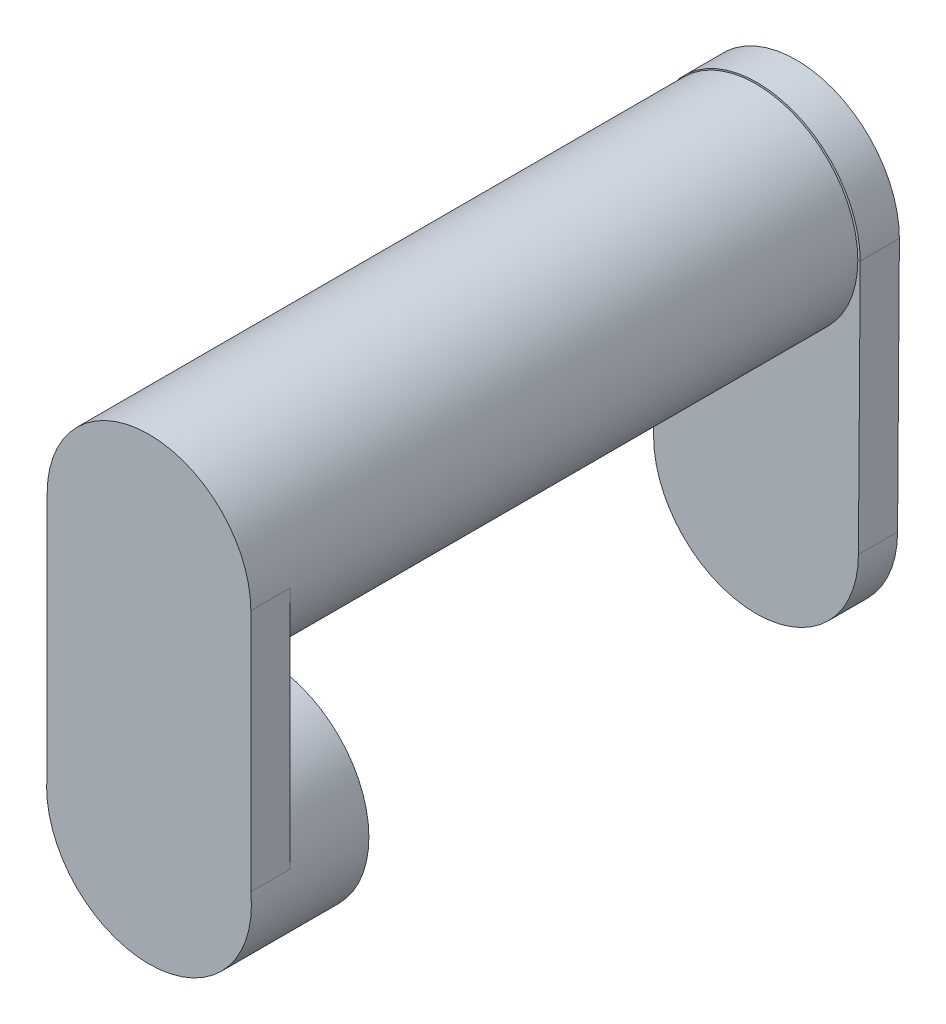
ISO-10303-21;
HEADER;
FILE_DESCRIPTION(('STEP AP214'),'2;1');
FILE_NAME('part.step','',(''),(''),'','','');
FILE_SCHEMA(('AUTOMOTIVE_DESIGN { 1 0 10303 214 1 1 1 1 }'));
ENDSEC;
DATA;
#1=APPLICATION_CONTEXT('core data for automotive mechanical design processes');
#2=APPLICATION_PROTOCOL_DEFINITION('international standard','automotive_design',2000,#1);
#3=PRODUCT_CONTEXT('',#1,'mechanical');
#4=PRODUCT('Part','Part','',(#3));
#5=PRODUCT_RELATED_PRODUCT_CATEGORY('part','',(#4));
#6=PRODUCT_DEFINITION_FORMATION('','',#4);
#7=PRODUCT_DEFINITION_CONTEXT('part definition',#1,'design');
#8=PRODUCT_DEFINITION('design','',#6,#7);
#9=PRODUCT_DEFINITION_SHAPE('','',#8);
#10=(LENGTH_UNIT() NAMED_UNIT(*) SI_UNIT(.MILLI.,.METRE.));
#11=(NAMED_UNIT(*) PLANE_ANGLE_UNIT() SI_UNIT($,.RADIAN.));
#12=(NAMED_UNIT(*) SI_UNIT($,.STERADIAN.) SOLID_ANGLE_UNIT());
#13=UNCERTAINTY_MEASURE_WITH_UNIT(LENGTH_MEASURE(1.E-05),#10,'distance_accuracy_value','');
#14=(GEOMETRIC_REPRESENTATION_CONTEXT(3) GLOBAL_UNCERTAINTY_ASSIGNED_CONTEXT((#13)) GLOBAL_UNIT_ASSIGNED_CONTEXT((#10,
#11,#12)) REPRESENTATION_CONTEXT('',''));
#15=CARTESIAN_POINT('',(0.,0.,0.));
#16=DIRECTION('',(0.,0.,1.));
#17=DIRECTION('',(1.,0.,0.));
#18=AXIS2_PLACEMENT_3D('',#15,#16,#17);
#19=CARTESIAN_POINT('',(0.,0.,30.));
#20=DIRECTION('',(0.,0.,-1.));
#21=DIRECTION('',(-1.,0.,0.));
#22=AXIS2_PLACEMENT_3D('',#19,#20,#21);
#23=CYLINDRICAL_SURFACE('',#22,20.4);
#24=CARTESIAN_POINT('',(0.,0.,0.));
#25=DIRECTION('',(0.,0.,1.));
#26=DIRECTION('',(1.,0.,0.));
#27=AXIS2_PLACEMENT_3D('',#24,#25,#26);
#28=CIRCLE('',#27,20.4);
#29=CARTESIAN_POINT('',(20.4,0.,0.));
#30=VERTEX_POINT('',#29);
#31=EDGE_CURVE('E185',#30,#30,#28,.T.);
#32=ORIENTED_EDGE('',*,*,#31,.F.);
#33=EDGE_LOOP('',(#32));
#34=FACE_BOUND('',#33,.T.);
#35=CARTESIAN_POINT('',(0.,0.,20.));
#36=DIRECTION('',(0.,0.,1.));
#37=DIRECTION('',(1.,0.,0.));
#38=AXIS2_PLACEMENT_3D('',#35,#36,#37);
#39=CIRCLE('',#38,20.4);
#40=CARTESIAN_POINT('',(20.4,0.,20.));
#41=VERTEX_POINT('',#40);
#42=EDGE_CURVE('E182',#41,#41,#39,.T.);
#43=ORIENTED_EDGE('',*,*,#42,.T.);
#44=EDGE_LOOP('',(#43));
#45=FACE_BOUND('',#44,.T.);
#46=ADVANCED_FACE('F49',(#34,#45),#23,.F.);
#47=CARTESIAN_POINT('',(0.,0.,30.));
#48=DIRECTION('',(0.,0.,1.));
#49=DIRECTION('',(1.,0.,0.));
#50=AXIS2_PLACEMENT_3D('',#47,#48,#49);
#51=PLANE('',#50);
#52=CARTESIAN_POINT('',(0.,0.,30.));
#53=DIRECTION('',(0.,0.,1.));
#54=DIRECTION('',(1.,0.,0.));
#55=AXIS2_PLACEMENT_3D('',#52,#53,#54);
#56=CIRCLE('',#55,26.15);
#57=CARTESIAN_POINT('',(-26.,2.79687325418945,30.));
#58=VERTEX_POINT('',#57);
#59=CARTESIAN_POINT('',(26.,2.79687325418946,30.));
#60=VERTEX_POINT('',#59);
#61=EDGE_CURVE('E189',#58,#60,#56,.T.);
#62=ORIENTED_EDGE('',*,*,#61,.T.);
#63=DIRECTION('',(0.,1.,0.));
#64=VECTOR('',#63,1.);
#65=CARTESIAN_POINT('',(26.,65.,30.));
#66=LINE('',#65,#64);
#67=CARTESIAN_POINT('',(26.,65.,30.));
#68=VERTEX_POINT('',#67);
#69=EDGE_CURVE('E172',#60,#68,#66,.T.);
#70=ORIENTED_EDGE('',*,*,#69,.T.);
#71=CARTESIAN_POINT('',(0.,65.,30.));
#72=DIRECTION('',(0.,0.,1.));
#73=DIRECTION('',(1.,0.,0.));
#74=AXIS2_PLACEMENT_3D('',#71,#72,#73);
#75=CIRCLE('',#74,26.);
#76=CARTESIAN_POINT('',(-26.,65.,30.));
#77=VERTEX_POINT('',#76);
#78=EDGE_CURVE('E168',#68,#77,#75,.T.);
#79=ORIENTED_EDGE('',*,*,#78,.T.);
#80=DIRECTION('',(0.,-1.,0.));
#81=VECTOR('',#80,1.);
#82=CARTESIAN_POINT('',(-26.,65.,30.));
#83=LINE('',#82,#81);
#84=EDGE_CURVE('E65',#77,#58,#83,.T.);
#85=ORIENTED_EDGE('',*,*,#84,.T.);
#86=EDGE_LOOP('',(#62,#70,#79,#85));
#87=FACE_BOUND('',#86,.T.);
#88=ADVANCED_FACE('F202',(#87),#51,.T.);
#89=CARTESIAN_POINT('',(0.,0.,0.));
#90=DIRECTION('',(0.,0.,1.));
#91=DIRECTION('',(1.,0.,0.));
#92=AXIS2_PLACEMENT_3D('',#89,#90,#91);
#93=PLANE('',#92);
#94=CARTESIAN_POINT('',(0.,0.,0.));
#95=DIRECTION('',(0.,0.,1.));
#96=DIRECTION('',(1.,0.,0.));
#97=AXIS2_PLACEMENT_3D('',#94,#95,#96);
#98=CIRCLE('',#97,26.15);
#99=CARTESIAN_POINT('',(26.15,0.,0.));
#100=VERTEX_POINT('',#99);
#101=EDGE_CURVE('E188',#100,#100,#98,.T.);
#102=ORIENTED_EDGE('',*,*,#101,.F.);
#103=EDGE_LOOP('',(#102));
#104=FACE_BOUND('',#103,.T.);
#105=ORIENTED_EDGE('',*,*,#31,.T.);
#106=EDGE_LOOP('',(#105));
#107=FACE_BOUND('',#106,.T.);
#108=ADVANCED_FACE('F237',(#104,#107),#93,.F.);
#109=CARTESIAN_POINT('',(0.,0.,30.));
#110=DIRECTION('',(0.,0.,-1.));
#111=DIRECTION('',(-1.,0.,0.));
#112=AXIS2_PLACEMENT_3D('',#109,#110,#111);
#113=CYLINDRICAL_SURFACE('',#112,26.15);
#114=CARTESIAN_POINT('',(0.,0.,20.));
#115=DIRECTION('',(0.,0.,1.));
#116=DIRECTION('',(1.,0.,0.));
#117=AXIS2_PLACEMENT_3D('',#114,#115,#116);
#118=CIRCLE('',#117,26.15);
#119=CARTESIAN_POINT('',(26.,2.79687325418946,20.));
#120=VERTEX_POINT('',#119);
#121=CARTESIAN_POINT('',(-26.,2.79687325418945,20.));
#122=VERTEX_POINT('',#121);
#123=EDGE_CURVE('E73',#120,#122,#118,.T.);
#124=ORIENTED_EDGE('',*,*,#123,.F.);
#125=DIRECTION('',(0.,0.,-1.));
#126=VECTOR('',#125,1.);
#127=CARTESIAN_POINT('',(26.,2.79687325418946,30.));
#128=LINE('',#127,#126);
#129=EDGE_CURVE('E58',#120,#60,#128,.F.);
#130=ORIENTED_EDGE('',*,*,#129,.T.);
#131=ORIENTED_EDGE('',*,*,#61,.F.);
#132=DIRECTION('',(0.,0.,-1.));
#133=VECTOR('',#132,1.);
#134=CARTESIAN_POINT('',(-26.,2.79687325418945,30.));
#135=LINE('',#134,#133);
#136=EDGE_CURVE('E191',#58,#122,#135,.T.);
#137=ORIENTED_EDGE('',*,*,#136,.T.);
#138=EDGE_LOOP('',(#124,#130,#131,#137));
#139=FACE_BOUND('',#138,.T.);
#140=ORIENTED_EDGE('',*,*,#101,.T.);
#141=EDGE_LOOP('',(#140));
#142=FACE_BOUND('',#141,.T.);
#143=ADVANCED_FACE('F51',(#139,#142),#113,.T.);
#144=CARTESIAN_POINT('',(0.,65.,20.));
#145=DIRECTION('',(0.,0.,1.));
#146=DIRECTION('',(1.,0.,0.));
#147=AXIS2_PLACEMENT_3D('',#144,#145,#146);
#148=PLANE('',#147);
#149=ORIENTED_EDGE('',*,*,#42,.F.);
#150=EDGE_LOOP('',(#149));
#151=FACE_BOUND('',#150,.T.);
#152=ADVANCED_FACE('F216',(#151),#148,.F.);
#153=CARTESIAN_POINT('',(26.,65.,20.));
#154=DIRECTION('',(1.,0.,0.));
#155=DIRECTION('',(0.,1.,0.));
#156=AXIS2_PLACEMENT_3D('',#153,#154,#155);
#157=PLANE('',#156);
#158=ORIENTED_EDGE('',*,*,#129,.F.);
#159=DIRECTION('',(0.,1.,0.));
#160=VECTOR('',#159,1.);
#161=CARTESIAN_POINT('',(26.,65.,20.));
#162=LINE('',#161,#160);
#163=CARTESIAN_POINT('',(26.,65.,20.));
#164=VERTEX_POINT('',#163);
#165=EDGE_CURVE('E171',#120,#164,#162,.T.);
#166=ORIENTED_EDGE('',*,*,#165,.T.);
#167=DIRECTION('',(0.,0.,1.));
#168=VECTOR('',#167,1.);
#169=CARTESIAN_POINT('',(26.,65.,20.));
#170=LINE('',#169,#168);
#171=EDGE_CURVE('E179',#164,#68,#170,.T.);
#172=ORIENTED_EDGE('',*,*,#171,.T.);
#173=ORIENTED_EDGE('',*,*,#69,.F.);
#174=EDGE_LOOP('',(#158,#166,#172,#173));
#175=FACE_BOUND('',#174,.T.);
#176=ADVANCED_FACE('F205',(#175),#157,.T.);
#177=CARTESIAN_POINT('',(-26.,65.,20.));
#178=DIRECTION('',(-1.,0.,0.));
#179=DIRECTION('',(0.,-1.,0.));
#180=AXIS2_PLACEMENT_3D('',#177,#178,#179);
#181=PLANE('',#180);
#182=ORIENTED_EDGE('',*,*,#136,.F.);
#183=ORIENTED_EDGE('',*,*,#84,.F.);
#184=DIRECTION('',(0.,0.,1.));
#185=VECTOR('',#184,1.);
#186=CARTESIAN_POINT('',(-26.,65.,20.));
#187=LINE('',#186,#185);
#188=CARTESIAN_POINT('',(-26.,65.,20.));
#189=VERTEX_POINT('',#188);
#190=EDGE_CURVE('E175',#189,#77,#187,.T.);
#191=ORIENTED_EDGE('',*,*,#190,.F.);
#192=DIRECTION('',(0.,-1.,0.));
#193=VECTOR('',#192,1.);
#194=CARTESIAN_POINT('',(-26.,65.,20.));
#195=LINE('',#194,#193);
#196=EDGE_CURVE('E169',#189,#122,#195,.T.);
#197=ORIENTED_EDGE('',*,*,#196,.T.);
#198=EDGE_LOOP('',(#182,#183,#191,#197));
#199=FACE_BOUND('',#198,.T.);
#200=ADVANCED_FACE('F211',(#199),#181,.T.);
#201=CARTESIAN_POINT('',(0.,65.,20.));
#202=DIRECTION('',(0.,0.,1.));
#203=DIRECTION('',(1.,0.,0.));
#204=AXIS2_PLACEMENT_3D('',#201,#202,#203);
#205=CYLINDRICAL_SURFACE('',#204,26.);
#206=ORIENTED_EDGE('',*,*,#78,.F.);
#207=ORIENTED_EDGE('',*,*,#171,.F.);
#208=CARTESIAN_POINT('',(0.,65.,20.));
#209=DIRECTION('',(0.,0.,1.));
#210=DIRECTION('',(1.,0.,0.));
#211=AXIS2_PLACEMENT_3D('',#208,#209,#210);
#212=CIRCLE('',#211,26.);
#213=EDGE_CURVE('E12',#164,#189,#212,.F.);
#214=ORIENTED_EDGE('',*,*,#213,.T.);
#215=ORIENTED_EDGE('',*,*,#190,.T.);
#216=EDGE_LOOP('',(#206,#207,#214,#215));
#217=FACE_BOUND('',#216,.T.);
#218=CARTESIAN_POINT('',(0.,65.,-125.));
#219=DIRECTION('',(0.,0.,-1.));
#220=DIRECTION('',(-1.,0.,0.));
#221=AXIS2_PLACEMENT_3D('',#218,#219,#220);
#222=CIRCLE('',#221,26.);
#223=CARTESIAN_POINT('',(-26.,65.,-125.));
#224=VERTEX_POINT('',#223);
#225=EDGE_CURVE('E165',#224,#224,#222,.T.);
#226=ORIENTED_EDGE('',*,*,#225,.F.);
#227=EDGE_LOOP('',(#226));
#228=FACE_BOUND('',#227,.T.);
#229=ADVANCED_FACE('F207',(#217,#228),#205,.T.);
#230=ORIENTED_EDGE('',*,*,#213,.F.);
#231=ORIENTED_EDGE('',*,*,#165,.F.);
#232=ORIENTED_EDGE('',*,*,#123,.T.);
#233=ORIENTED_EDGE('',*,*,#196,.F.);
#234=EDGE_LOOP('',(#230,#231,#232,#233));
#235=FACE_BOUND('',#234,.T.);
#236=ADVANCED_FACE('F212',(#235),#148,.F.);
#237=CARTESIAN_POINT('',(-26.1498607403866,0.0603458324778156,-135.));
#238=DIRECTION('',(-0.999997337288742,0.00230768616297403,0.));
#239=DIRECTION('',(-0.00230768616297403,-0.999997337288742,0.));
#240=AXIS2_PLACEMENT_3D('',#237,#238,#239);
#241=PLANE('',#240);
#242=DIRECTION('',(-0.00230768616297403,-0.999997337288742,0.));
#243=VECTOR('',#242,1.);
#244=CARTESIAN_POINT('',(-26.1498607403866,0.0603458324778156,-125.));
#245=LINE('',#244,#243);
#246=CARTESIAN_POINT('',(-26.0024469691093,63.9396467192885,-125.));
#247=VERTEX_POINT('',#246);
#248=CARTESIAN_POINT('',(-26.15,0.,-125.));
#249=VERTEX_POINT('',#248);
#250=EDGE_CURVE('E124',#247,#249,#245,.T.);
#251=ORIENTED_EDGE('',*,*,#250,.F.);
#252=DIRECTION('',(0.,0.,1.));
#253=VECTOR('',#252,1.);
#254=CARTESIAN_POINT('',(-26.0024469691093,63.9396467192885,-135.));
#255=LINE('',#254,#253);
#256=CARTESIAN_POINT('',(-26.0024469691093,63.9396467192885,-135.));
#257=VERTEX_POINT('',#256);
#258=EDGE_CURVE('E118',#257,#247,#255,.T.);
#259=ORIENTED_EDGE('',*,*,#258,.F.);
#260=DIRECTION('',(-0.00230768616297403,-0.999997337288742,0.));
#261=VECTOR('',#260,1.);
#262=CARTESIAN_POINT('',(-26.1498607403866,0.0603458324778156,-135.));
#263=LINE('',#262,#261);
#264=CARTESIAN_POINT('',(-26.15,0.,-135.));
#265=VERTEX_POINT('',#264);
#266=EDGE_CURVE('E122',#257,#265,#263,.T.);
#267=ORIENTED_EDGE('',*,*,#266,.T.);
#268=DIRECTION('',(0.,0.,1.));
#269=VECTOR('',#268,1.);
#270=CARTESIAN_POINT('',(-26.15,0.,-135.));
#271=LINE('',#270,#269);
#272=EDGE_CURVE('E150',#265,#249,#271,.T.);
#273=ORIENTED_EDGE('',*,*,#272,.T.);
#274=EDGE_LOOP('',(#251,#259,#267,#273));
#275=FACE_BOUND('',#274,.T.);
#276=ADVANCED_FACE('F120',(#275),#241,.T.);
#277=CARTESIAN_POINT('',(0.291938013851514,65.1347346864853,-135.));
#278=DIRECTION('',(0.,0.,1.));
#279=DIRECTION('',(1.,0.,0.));
#280=AXIS2_PLACEMENT_3D('',#277,#278,#279);
#281=CYLINDRICAL_SURFACE('',#280,26.3215295315735);
#282=CARTESIAN_POINT('',(0.291938013851514,65.1347346864853,-125.));
#283=DIRECTION('',(0.,0.,-1.));
#284=DIRECTION('',(-1.,0.,0.));
#285=AXIS2_PLACEMENT_3D('',#282,#283,#284);
#286=CIRCLE('',#285,26.3215295315735);
#287=CARTESIAN_POINT('',(26.613467545425,65.1347346864853,-125.));
#288=VERTEX_POINT('',#287);
#289=EDGE_CURVE('E152',#247,#288,#286,.T.);
#290=ORIENTED_EDGE('',*,*,#289,.T.);
#291=DIRECTION('',(0.,0.,1.));
#292=VECTOR('',#291,1.);
#293=CARTESIAN_POINT('',(26.613467545425,65.1347346864853,-135.));
#294=LINE('',#293,#292);
#295=CARTESIAN_POINT('',(26.613467545425,65.1347346864853,-135.));
#296=VERTEX_POINT('',#295);
#297=EDGE_CURVE('E128',#296,#288,#294,.T.);
#298=ORIENTED_EDGE('',*,*,#297,.F.);
#299=CARTESIAN_POINT('',(0.291938013851514,65.1347346864853,-135.));
#300=DIRECTION('',(0.,0.,-1.));
#301=DIRECTION('',(-1.,0.,0.));
#302=AXIS2_PLACEMENT_3D('',#299,#300,#301);
#303=CIRCLE('',#302,26.3215295315735);
#304=EDGE_CURVE('E131',#257,#296,#303,.T.);
#305=ORIENTED_EDGE('',*,*,#304,.F.);
#306=ORIENTED_EDGE('',*,*,#258,.T.);
#307=EDGE_LOOP('',(#290,#298,#305,#306));
#308=FACE_BOUND('',#307,.T.);
#309=ADVANCED_FACE('F132',(#308),#281,.T.);
#310=CARTESIAN_POINT('',(26.1486760759725,-0.18606144287526,-135.));
#311=DIRECTION('',(-0.999974685644663,0.00711534045965502,0.));
#312=DIRECTION('',(-0.00711534045965502,-0.999974685644663,0.));
#313=AXIS2_PLACEMENT_3D('',#310,#311,#312);
#314=PLANE('',#313);
#315=DIRECTION('',(-0.00711534045965502,-0.999974685644663,0.));
#316=VECTOR('',#315,1.);
#317=CARTESIAN_POINT('',(26.1486760759725,-0.18606144287526,-125.));
#318=LINE('',#317,#316);
#319=CARTESIAN_POINT('',(26.1499999999992,0.,-125.));
#320=VERTEX_POINT('',#319);
#321=EDGE_CURVE('E145',#288,#320,#318,.T.);
#322=ORIENTED_EDGE('',*,*,#321,.T.);
#323=DIRECTION('',(0.,0.,1.));
#324=VECTOR('',#323,1.);
#325=CARTESIAN_POINT('',(26.1499999999992,0.,-135.));
#326=LINE('',#325,#324);
#327=CARTESIAN_POINT('',(26.1499999999992,0.,-135.));
#328=VERTEX_POINT('',#327);
#329=EDGE_CURVE('E156',#328,#320,#326,.T.);
#330=ORIENTED_EDGE('',*,*,#329,.F.);
#331=DIRECTION('',(-0.00711534045965502,-0.999974685644663,0.));
#332=VECTOR('',#331,1.);
#333=CARTESIAN_POINT('',(26.1486760759725,-0.18606144287526,-135.));
#334=LINE('',#333,#332);
#335=EDGE_CURVE('E136',#296,#328,#334,.T.);
#336=ORIENTED_EDGE('',*,*,#335,.F.);
#337=ORIENTED_EDGE('',*,*,#297,.T.);
#338=EDGE_LOOP('',(#322,#330,#336,#337));
#339=FACE_BOUND('',#338,.T.);
#340=ADVANCED_FACE('F307',(#339),#314,.F.);
#341=CARTESIAN_POINT('',(0.,0.,-135.));
#342=DIRECTION('',(0.,0.,1.));
#343=DIRECTION('',(1.,0.,0.));
#344=AXIS2_PLACEMENT_3D('',#341,#342,#343);
#345=CYLINDRICAL_SURFACE('',#344,26.1499999999992);
#346=CARTESIAN_POINT('',(0.,0.,-125.));
#347=DIRECTION('',(0.,0.,-1.));
#348=DIRECTION('',(-1.,0.,0.));
#349=AXIS2_PLACEMENT_3D('',#346,#347,#348);
#350=CIRCLE('',#349,26.1499999999992);
#351=EDGE_CURVE('E142',#320,#249,#350,.T.);
#352=ORIENTED_EDGE('',*,*,#351,.T.);
#353=ORIENTED_EDGE('',*,*,#272,.F.);
#354=CARTESIAN_POINT('',(0.,0.,-135.));
#355=DIRECTION('',(0.,0.,-1.));
#356=DIRECTION('',(-1.,0.,0.));
#357=AXIS2_PLACEMENT_3D('',#354,#355,#356);
#358=CIRCLE('',#357,26.1499999999992);
#359=EDGE_CURVE('E140',#328,#265,#358,.T.);
#360=ORIENTED_EDGE('',*,*,#359,.F.);
#361=ORIENTED_EDGE('',*,*,#329,.T.);
#362=EDGE_LOOP('',(#352,#353,#360,#361));
#363=FACE_BOUND('',#362,.T.);
#364=ADVANCED_FACE('F316',(#363),#345,.T.);
#365=CARTESIAN_POINT('',(0.,0.,-135.));
#366=DIRECTION('',(0.,0.,-1.));
#367=DIRECTION('',(-1.,0.,0.));
#368=AXIS2_PLACEMENT_3D('',#365,#366,#367);
#369=PLANE('',#368);
#370=ORIENTED_EDGE('',*,*,#266,.F.);
#371=ORIENTED_EDGE('',*,*,#304,.T.);
#372=ORIENTED_EDGE('',*,*,#335,.T.);
#373=ORIENTED_EDGE('',*,*,#359,.T.);
#374=EDGE_LOOP('',(#370,#371,#372,#373));
#375=FACE_BOUND('',#374,.T.);
#376=ADVANCED_FACE('F138',(#375),#369,.T.);
#377=CARTESIAN_POINT('',(0.,0.,-125.));
#378=DIRECTION('',(0.,0.,-1.));
#379=DIRECTION('',(-1.,0.,0.));
#380=AXIS2_PLACEMENT_3D('',#377,#378,#379);
#381=PLANE('',#380);
#382=ORIENTED_EDGE('',*,*,#225,.T.);
#383=EDGE_LOOP('',(#382));
#384=FACE_BOUND('',#383,.T.);
#385=ORIENTED_EDGE('',*,*,#250,.T.);
#386=ORIENTED_EDGE('',*,*,#351,.F.);
#387=ORIENTED_EDGE('',*,*,#321,.F.);
#388=ORIENTED_EDGE('',*,*,#289,.F.);
#389=EDGE_LOOP('',(#385,#386,#387,#388));
#390=FACE_BOUND('',#389,.T.);
#391=ADVANCED_FACE('F335',(#384,#390),#381,.F.);
#392=CLOSED_SHELL('',(#46,#88,#108,#143,#152,#176,#200,#229,#236,#276,#309,#340,#364,#376,#391));
#393=CARTESIAN_POINT('',(0.,65.,20.));
#394=DIRECTION('',(0.,0.,-1.));
#395=DIRECTION('',(-1.,0.,0.));
#396=AXIS2_PLACEMENT_3D('',#393,#394,#395);
#397=CIRCLE('',#396,18.);
#398=CARTESIAN_POINT('',(-18.,65.,20.));
#399=VERTEX_POINT('',#398);
#400=EDGE_CURVE('E162',#399,#399,#397,.T.);
#401=ORIENTED_EDGE('',*,*,#400,.T.);
#402=EDGE_LOOP('',(#401));
#403=FACE_BOUND('',#402,.T.);
#404=ADVANCED_FACE('F215',(#403),#148,.F.);
#405=CARTESIAN_POINT('',(0.,65.,-125.));
#406=DIRECTION('',(0.,0.,1.));
#407=DIRECTION('',(1.,0.,0.));
#408=AXIS2_PLACEMENT_3D('',#405,#406,#407);
#409=CYLINDRICAL_SURFACE('',#408,18.);
#410=CARTESIAN_POINT('',(0.,65.,-125.));
#411=DIRECTION('',(0.,0.,-1.));
#412=DIRECTION('',(-1.,0.,0.));
#413=AXIS2_PLACEMENT_3D('',#410,#411,#412);
#414=CIRCLE('',#413,18.);
#415=CARTESIAN_POINT('',(-18.,65.,-125.));
#416=VERTEX_POINT('',#415);
#417=EDGE_CURVE('E127',#416,#416,#414,.T.);
#418=ORIENTED_EDGE('',*,*,#417,.T.);
#419=EDGE_LOOP('',(#418));
#420=FACE_BOUND('',#419,.T.);
#421=ORIENTED_EDGE('',*,*,#400,.F.);
#422=EDGE_LOOP('',(#421));
#423=FACE_BOUND('',#422,.T.);
#424=ADVANCED_FACE('F226',(#420,#423),#409,.F.);
#425=ORIENTED_EDGE('',*,*,#417,.F.);
#426=EDGE_LOOP('',(#425));
#427=FACE_BOUND('',#426,.T.);
#428=ADVANCED_FACE('F285',(#427),#381,.F.);
#429=CLOSED_SHELL('',(#404,#424,#428));
#430=ORIENTED_CLOSED_SHELL('',*,#429,.T.);
#431=BREP_WITH_VOIDS('B2',#392,(#430));
#432=ADVANCED_BREP_SHAPE_REPRESENTATION('',(#18,#431),#14);
#433=SHAPE_DEFINITION_REPRESENTATION(#9,#432);
ENDSEC;
END-ISO-10303-21;
